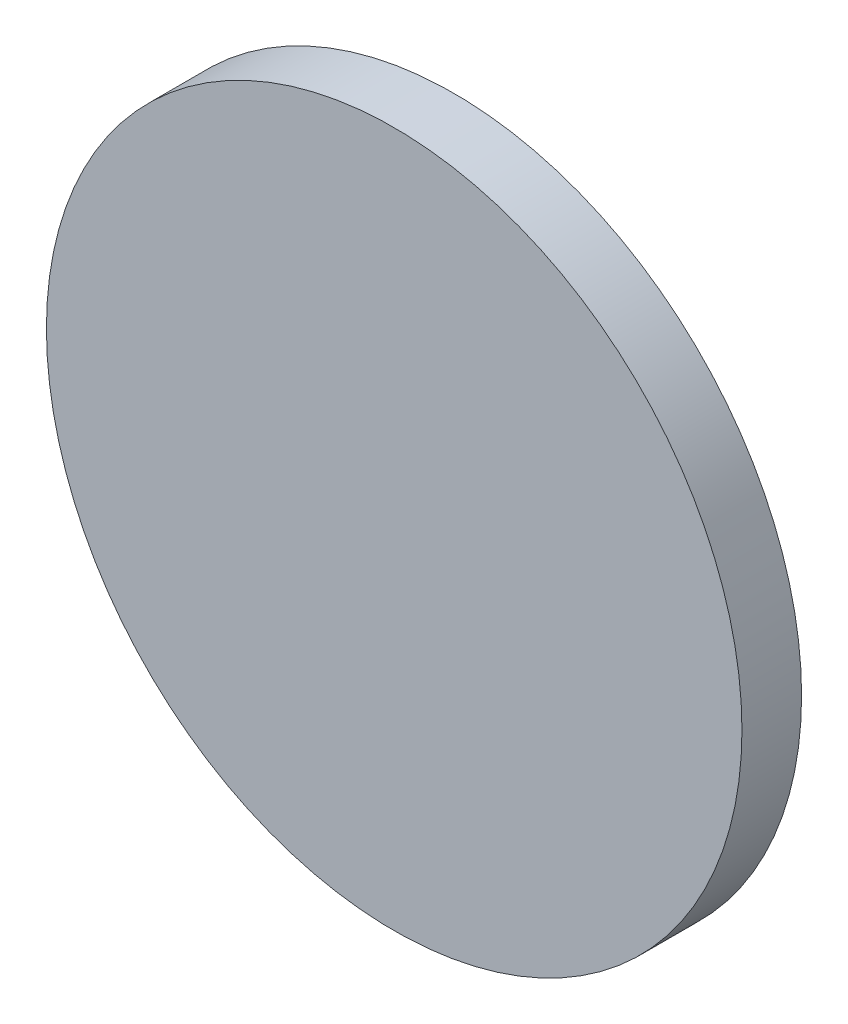
ISO-10303-21;
HEADER;
FILE_DESCRIPTION(('STEP AP214'),'2;1');
FILE_NAME('part.step','',(''),(''),'','','');
FILE_SCHEMA(('AUTOMOTIVE_DESIGN { 1 0 10303 214 1 1 1 1 }'));
ENDSEC;
DATA;
#1=APPLICATION_CONTEXT('core data for automotive mechanical design processes');
#2=APPLICATION_PROTOCOL_DEFINITION('international standard','automotive_design',2000,#1);
#3=PRODUCT_CONTEXT('',#1,'mechanical');
#4=PRODUCT('Part','Part','',(#3));
#5=PRODUCT_RELATED_PRODUCT_CATEGORY('part','',(#4));
#6=PRODUCT_DEFINITION_FORMATION('','',#4);
#7=PRODUCT_DEFINITION_CONTEXT('part definition',#1,'design');
#8=PRODUCT_DEFINITION('design','',#6,#7);
#9=PRODUCT_DEFINITION_SHAPE('','',#8);
#10=(LENGTH_UNIT() NAMED_UNIT(*) SI_UNIT(.MILLI.,.METRE.));
#11=(NAMED_UNIT(*) PLANE_ANGLE_UNIT() SI_UNIT($,.RADIAN.));
#12=(NAMED_UNIT(*) SI_UNIT($,.STERADIAN.) SOLID_ANGLE_UNIT());
#13=UNCERTAINTY_MEASURE_WITH_UNIT(LENGTH_MEASURE(1.E-05),#10,'distance_accuracy_value','');
#14=(GEOMETRIC_REPRESENTATION_CONTEXT(3) GLOBAL_UNCERTAINTY_ASSIGNED_CONTEXT((#13)) GLOBAL_UNIT_ASSIGNED_CONTEXT((#10,
#11,#12)) REPRESENTATION_CONTEXT('',''));
#15=CARTESIAN_POINT('',(0.,0.,0.));
#16=DIRECTION('',(0.,0.,1.));
#17=DIRECTION('',(1.,0.,0.));
#18=AXIS2_PLACEMENT_3D('',#15,#16,#17);
#19=CARTESIAN_POINT('',(2.54508,8.859520006176,0.));
#20=DIRECTION('',(0.,0.,-1.));
#21=DIRECTION('',(-1.,0.,0.));
#22=AXIS2_PLACEMENT_3D('',#19,#20,#21);
#23=PLANE('',#22);
#24=CARTESIAN_POINT('',(2.54508,8.859520006176,0.));
#25=DIRECTION('',(0.,0.,1.));
#26=DIRECTION('',(1.,0.,0.));
#27=AXIS2_PLACEMENT_3D('',#24,#25,#26);
#28=CIRCLE('',#27,0.200024667);
#29=CARTESIAN_POINT('',(2.745104667,8.859520006176,0.));
#30=VERTEX_POINT('',#29);
#31=EDGE_CURVE('E18',#30,#30,#28,.T.);
#32=ORIENTED_EDGE('',*,*,#31,.F.);
#33=EDGE_LOOP('',(#32));
#34=FACE_BOUND('',#33,.T.);
#35=ADVANCED_FACE('F15',(#34),#23,.T.);
#36=CARTESIAN_POINT('',(2.54508,8.859520006176,0.));
#37=DIRECTION('',(0.,0.,1.));
#38=DIRECTION('',(1.,0.,0.));
#39=AXIS2_PLACEMENT_3D('',#36,#37,#38);
#40=CYLINDRICAL_SURFACE('',#39,0.200024667);
#41=CARTESIAN_POINT('',(2.54508,8.859520006176,0.03429));
#42=DIRECTION('',(0.,0.,1.));
#43=DIRECTION('',(1.,0.,0.));
#44=AXIS2_PLACEMENT_3D('',#41,#42,#43);
#45=CIRCLE('',#44,0.200024667);
#46=CARTESIAN_POINT('',(2.745104667,8.859520006176,0.03429));
#47=VERTEX_POINT('',#46);
#48=EDGE_CURVE('E10',#47,#47,#45,.T.);
#49=ORIENTED_EDGE('',*,*,#48,.F.);
#50=EDGE_LOOP('',(#49));
#51=FACE_BOUND('',#50,.T.);
#52=ORIENTED_EDGE('',*,*,#31,.T.);
#53=EDGE_LOOP('',(#52));
#54=FACE_BOUND('',#53,.T.);
#55=ADVANCED_FACE('F27',(#51,#54),#40,.T.);
#56=CARTESIAN_POINT('',(2.54508,8.859520006176,0.03429));
#57=DIRECTION('',(0.,0.,1.));
#58=DIRECTION('',(1.,0.,0.));
#59=AXIS2_PLACEMENT_3D('',#56,#57,#58);
#60=PLANE('',#59);
#61=ORIENTED_EDGE('',*,*,#48,.T.);
#62=EDGE_LOOP('',(#61));
#63=FACE_BOUND('',#62,.T.);
#64=ADVANCED_FACE('F34',(#63),#60,.T.);
#65=CLOSED_SHELL('',(#35,#55,#64));
#66=MANIFOLD_SOLID_BREP('B1',#65);
#67=ADVANCED_BREP_SHAPE_REPRESENTATION('',(#18,#66),#14);
#68=SHAPE_DEFINITION_REPRESENTATION(#9,#67);
ENDSEC;
END-ISO-10303-21;
